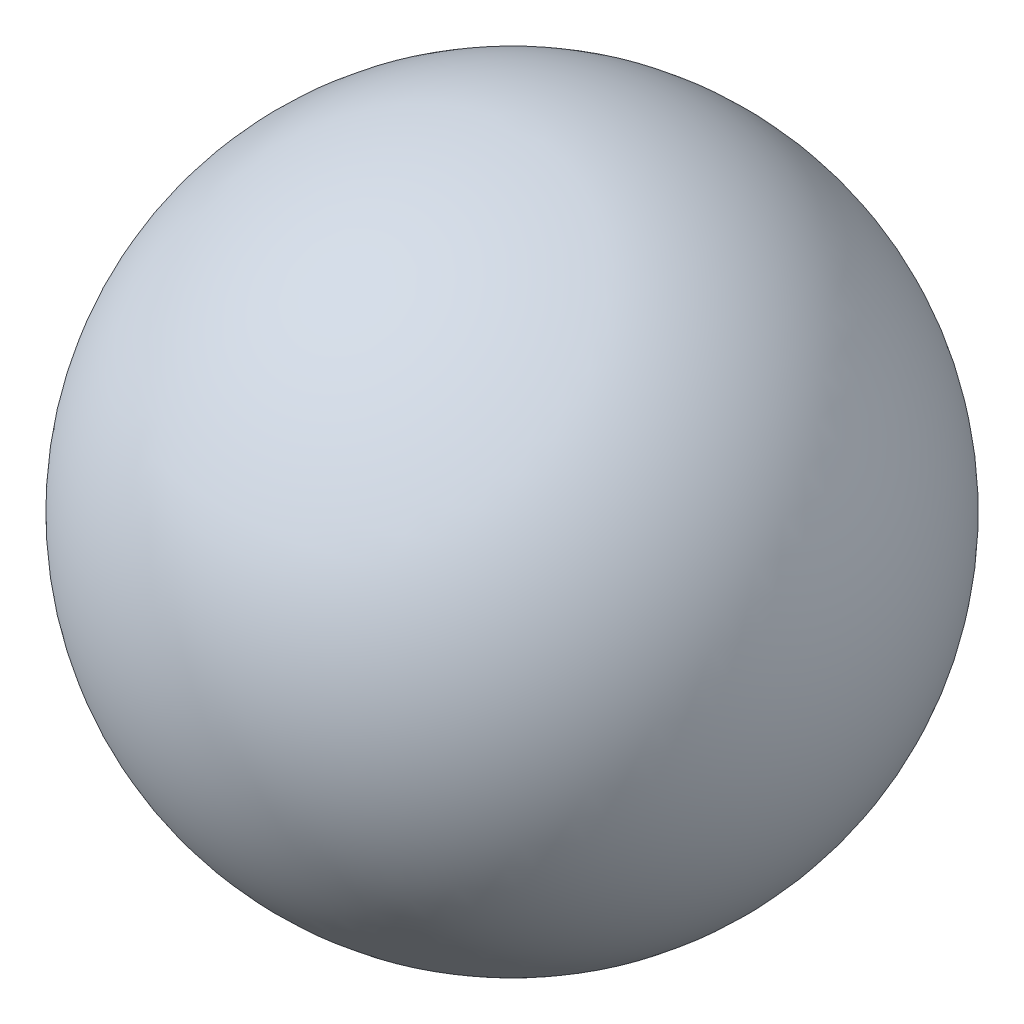
ISO-10303-21;
HEADER;
FILE_DESCRIPTION(('STEP AP214'),'2;1');
FILE_NAME('part.step','',(''),(''),'','','');
FILE_SCHEMA(('AUTOMOTIVE_DESIGN { 1 0 10303 214 1 1 1 1 }'));
ENDSEC;
DATA;
#1=APPLICATION_CONTEXT('core data for automotive mechanical design processes');
#2=APPLICATION_PROTOCOL_DEFINITION('international standard','automotive_design',2000,#1);
#3=PRODUCT_CONTEXT('',#1,'mechanical');
#4=PRODUCT('Part','Part','',(#3));
#5=PRODUCT_RELATED_PRODUCT_CATEGORY('part','',(#4));
#6=PRODUCT_DEFINITION_FORMATION('','',#4);
#7=PRODUCT_DEFINITION_CONTEXT('part definition',#1,'design');
#8=PRODUCT_DEFINITION('design','',#6,#7);
#9=PRODUCT_DEFINITION_SHAPE('','',#8);
#10=(LENGTH_UNIT() NAMED_UNIT(*) SI_UNIT(.MILLI.,.METRE.));
#11=(NAMED_UNIT(*) PLANE_ANGLE_UNIT() SI_UNIT($,.RADIAN.));
#12=(NAMED_UNIT(*) SI_UNIT($,.STERADIAN.) SOLID_ANGLE_UNIT());
#13=UNCERTAINTY_MEASURE_WITH_UNIT(LENGTH_MEASURE(1.E-05),#10,'distance_accuracy_value','');
#14=(GEOMETRIC_REPRESENTATION_CONTEXT(3) GLOBAL_UNCERTAINTY_ASSIGNED_CONTEXT((#13)) GLOBAL_UNIT_ASSIGNED_CONTEXT((#10,
#11,#12)) REPRESENTATION_CONTEXT('',''));
#15=CARTESIAN_POINT('',(0.,0.,0.));
#16=DIRECTION('',(0.,0.,1.));
#17=DIRECTION('',(1.,0.,0.));
#18=AXIS2_PLACEMENT_3D('',#15,#16,#17);
#19=CARTESIAN_POINT('',(0.,0.,0.));
#20=DIRECTION('',(0.,1.,0.));
#21=DIRECTION('',(1.,0.,0.));
#22=AXIS2_PLACEMENT_3D('',#19,#20,#21);
#23=SPHERICAL_SURFACE('',#22,6.35);
#24=CARTESIAN_POINT('',(0.,6.35,0.));
#25=VERTEX_POINT('',#24);
#26=VERTEX_LOOP('',#25);
#27=FACE_BOUND('',#26,.T.);
#28=ADVANCED_FACE('F29',(#27),#23,.T.);
#29=CLOSED_SHELL('',(#28));
#30=MANIFOLD_SOLID_BREP('B2',#29);
#31=ADVANCED_BREP_SHAPE_REPRESENTATION('',(#18,#30),#14);
#32=SHAPE_DEFINITION_REPRESENTATION(#9,#31);
ENDSEC;
END-ISO-10303-21;
